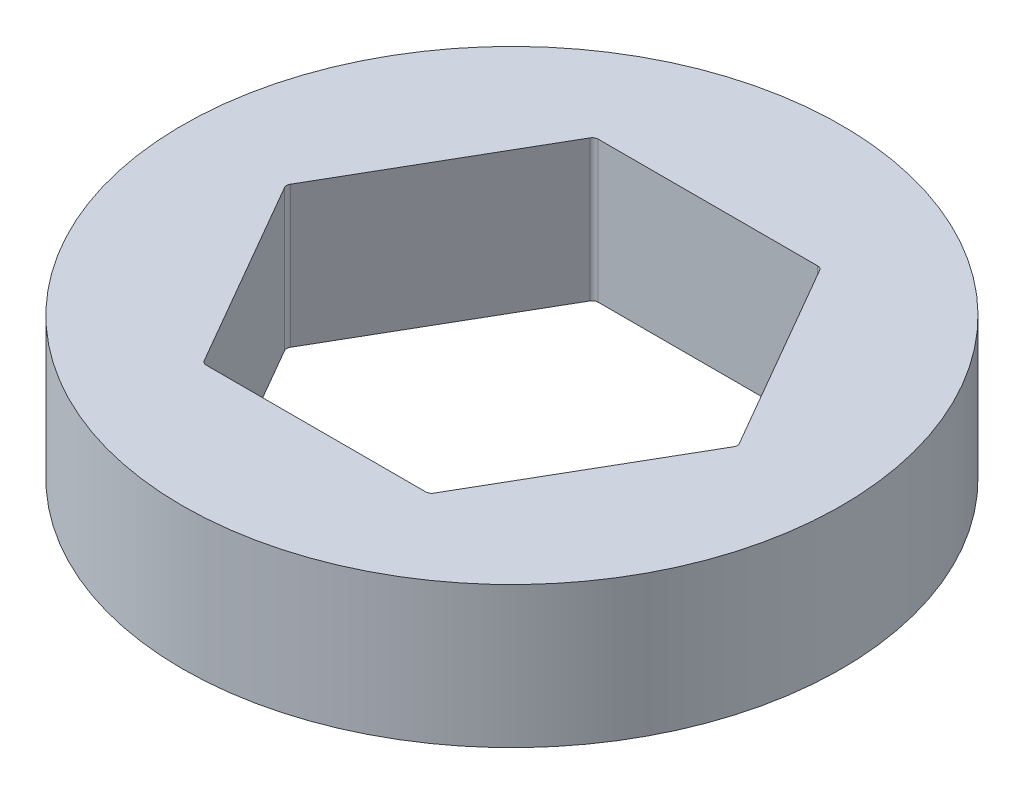
ISO-10303-21;
HEADER;
FILE_DESCRIPTION(('STEP AP214'),'2;1');
FILE_NAME('part.step','',(''),(''),'','','');
FILE_SCHEMA(('AUTOMOTIVE_DESIGN { 1 0 10303 214 1 1 1 1 }'));
ENDSEC;
DATA;
#1=APPLICATION_CONTEXT('core data for automotive mechanical design processes');
#2=APPLICATION_PROTOCOL_DEFINITION('international standard','automotive_design',2000,#1);
#3=PRODUCT_CONTEXT('',#1,'mechanical');
#4=PRODUCT('Part','Part','',(#3));
#5=PRODUCT_RELATED_PRODUCT_CATEGORY('part','',(#4));
#6=PRODUCT_DEFINITION_FORMATION('','',#4);
#7=PRODUCT_DEFINITION_CONTEXT('part definition',#1,'design');
#8=PRODUCT_DEFINITION('design','',#6,#7);
#9=PRODUCT_DEFINITION_SHAPE('','',#8);
#10=(LENGTH_UNIT() NAMED_UNIT(*) SI_UNIT(.MILLI.,.METRE.));
#11=(NAMED_UNIT(*) PLANE_ANGLE_UNIT() SI_UNIT($,.RADIAN.));
#12=(NAMED_UNIT(*) SI_UNIT($,.STERADIAN.) SOLID_ANGLE_UNIT());
#13=UNCERTAINTY_MEASURE_WITH_UNIT(LENGTH_MEASURE(1.E-05),#10,'distance_accuracy_value','');
#14=(GEOMETRIC_REPRESENTATION_CONTEXT(3) GLOBAL_UNCERTAINTY_ASSIGNED_CONTEXT((#13)) GLOBAL_UNIT_ASSIGNED_CONTEXT((#10,
#11,#12)) REPRESENTATION_CONTEXT('',''));
#15=CARTESIAN_POINT('',(0.,0.,0.));
#16=DIRECTION('',(0.,0.,1.));
#17=DIRECTION('',(1.,0.,0.));
#18=AXIS2_PLACEMENT_3D('',#15,#16,#17);
#19=CARTESIAN_POINT('',(0.,4.7625,0.));
#20=DIRECTION('',(0.,1.,0.));
#21=DIRECTION('',(0.,0.,1.));
#22=AXIS2_PLACEMENT_3D('',#19,#20,#21);
#23=PLANE('',#22);
#24=CARTESIAN_POINT('',(0.,4.7625,0.));
#25=DIRECTION('',(0.,1.,0.));
#26=DIRECTION('',(0.,0.,1.));
#27=AXIS2_PLACEMENT_3D('',#24,#25,#26);
#28=CIRCLE('',#27,11.1125);
#29=CARTESIAN_POINT('',(0.,4.7625,11.1125));
#30=VERTEX_POINT('',#29);
#31=EDGE_CURVE('E147',#30,#30,#28,.T.);
#32=ORIENTED_EDGE('',*,*,#31,.T.);
#33=EDGE_LOOP('',(#32));
#34=FACE_BOUND('',#33,.T.);
#35=DIRECTION('',(-0.5,0.,-0.866025403784438));
#36=VECTOR('',#35,1.);
#37=CARTESIAN_POINT('',(7.62564235545658,4.7625,0.));
#38=LINE('',#37,#36);
#39=CARTESIAN_POINT('',(7.56790732853761,4.7625,-0.100000000000002));
#40=VERTEX_POINT('',#39);
#41=CARTESIAN_POINT('',(3.87055620464725,4.7625,-6.504));
#42=VERTEX_POINT('',#41);
#43=EDGE_CURVE('E248',#40,#42,#38,.T.);
#44=ORIENTED_EDGE('',*,*,#43,.F.);
#45=CARTESIAN_POINT('',(7.39470224778073,4.7625,0.));
#46=DIRECTION('',(0.,1.,0.));
#47=DIRECTION('',(0.,0.,1.));
#48=AXIS2_PLACEMENT_3D('',#45,#46,#47);
#49=CIRCLE('',#48,0.2);
#50=CARTESIAN_POINT('',(7.56790732853762,4.7625,0.0999999999999968));
#51=VERTEX_POINT('',#50);
#52=EDGE_CURVE('E50',#40,#51,#49,.F.);
#53=ORIENTED_EDGE('',*,*,#52,.T.);
#54=DIRECTION('',(0.5,0.,-0.866025403784439));
#55=VECTOR('',#54,1.);
#56=CARTESIAN_POINT('',(3.81282117772829,4.7625,6.604));
#57=LINE('',#56,#55);
#58=CARTESIAN_POINT('',(3.87055620464725,4.7625,6.50400000000001));
#59=VERTEX_POINT('',#58);
#60=EDGE_CURVE('E206',#59,#51,#57,.T.);
#61=ORIENTED_EDGE('',*,*,#60,.F.);
#62=CARTESIAN_POINT('',(3.69735112389036,4.7625,6.40400000000001));
#63=DIRECTION('',(0.,1.,0.));
#64=DIRECTION('',(0.,0.,1.));
#65=AXIS2_PLACEMENT_3D('',#62,#63,#64);
#66=CIRCLE('',#65,0.2);
#67=CARTESIAN_POINT('',(3.69735112389036,4.7625,6.604));
#68=VERTEX_POINT('',#67);
#69=EDGE_CURVE('E135',#59,#68,#66,.F.);
#70=ORIENTED_EDGE('',*,*,#69,.T.);
#71=DIRECTION('',(1.,0.,0.));
#72=VECTOR('',#71,1.);
#73=CARTESIAN_POINT('',(-3.81282117772829,4.7625,6.604));
#74=LINE('',#73,#72);
#75=CARTESIAN_POINT('',(-3.69735112389036,4.7625,6.604));
#76=VERTEX_POINT('',#75);
#77=EDGE_CURVE('E213',#76,#68,#74,.T.);
#78=ORIENTED_EDGE('',*,*,#77,.F.);
#79=CARTESIAN_POINT('',(-3.69735112389036,4.7625,6.40400000000001));
#80=DIRECTION('',(0.,1.,0.));
#81=DIRECTION('',(0.,0.,1.));
#82=AXIS2_PLACEMENT_3D('',#79,#80,#81);
#83=CIRCLE('',#82,0.2);
#84=CARTESIAN_POINT('',(-3.87055620464725,4.7625,6.50400000000001));
#85=VERTEX_POINT('',#84);
#86=EDGE_CURVE('E11',#76,#85,#83,.F.);
#87=ORIENTED_EDGE('',*,*,#86,.T.);
#88=DIRECTION('',(0.5,0.,0.866025403784439));
#89=VECTOR('',#88,1.);
#90=CARTESIAN_POINT('',(-7.62564235545658,4.7625,0.));
#91=LINE('',#90,#89);
#92=CARTESIAN_POINT('',(-7.56790732853762,4.7625,0.1));
#93=VERTEX_POINT('',#92);
#94=EDGE_CURVE('E211',#93,#85,#91,.T.);
#95=ORIENTED_EDGE('',*,*,#94,.F.);
#96=CARTESIAN_POINT('',(-7.39470224778073,4.7625,0.));
#97=DIRECTION('',(0.,1.,0.));
#98=DIRECTION('',(0.,0.,1.));
#99=AXIS2_PLACEMENT_3D('',#96,#97,#98);
#100=CIRCLE('',#99,0.2);
#101=CARTESIAN_POINT('',(-7.56790732853762,4.7625,-0.0999999999999994));
#102=VERTEX_POINT('',#101);
#103=EDGE_CURVE('E188',#93,#102,#100,.F.);
#104=ORIENTED_EDGE('',*,*,#103,.T.);
#105=DIRECTION('',(-0.5,0.,0.866025403784439));
#106=VECTOR('',#105,1.);
#107=CARTESIAN_POINT('',(-3.81282117772829,4.7625,-6.604));
#108=LINE('',#107,#106);
#109=CARTESIAN_POINT('',(-3.87055620464725,4.7625,-6.504));
#110=VERTEX_POINT('',#109);
#111=EDGE_CURVE('E217',#110,#102,#108,.T.);
#112=ORIENTED_EDGE('',*,*,#111,.F.);
#113=CARTESIAN_POINT('',(-3.69735112389037,4.7625,-6.404));
#114=DIRECTION('',(0.,1.,0.));
#115=DIRECTION('',(0.,0.,1.));
#116=AXIS2_PLACEMENT_3D('',#113,#114,#115);
#117=CIRCLE('',#116,0.2);
#118=CARTESIAN_POINT('',(-3.69735112389037,4.7625,-6.604));
#119=VERTEX_POINT('',#118);
#120=EDGE_CURVE('E184',#110,#119,#117,.F.);
#121=ORIENTED_EDGE('',*,*,#120,.T.);
#122=DIRECTION('',(-1.,0.,0.));
#123=VECTOR('',#122,1.);
#124=CARTESIAN_POINT('',(3.81282117772829,4.7625,-6.604));
#125=LINE('',#124,#123);
#126=CARTESIAN_POINT('',(3.69735112389036,4.7625,-6.604));
#127=VERTEX_POINT('',#126);
#128=EDGE_CURVE('E221',#127,#119,#125,.T.);
#129=ORIENTED_EDGE('',*,*,#128,.F.);
#130=CARTESIAN_POINT('',(3.69735112389036,4.7625,-6.404));
#131=DIRECTION('',(0.,1.,0.));
#132=DIRECTION('',(0.,0.,1.));
#133=AXIS2_PLACEMENT_3D('',#130,#131,#132);
#134=CIRCLE('',#133,0.2);
#135=EDGE_CURVE('E180',#127,#42,#134,.F.);
#136=ORIENTED_EDGE('',*,*,#135,.T.);
#137=EDGE_LOOP('',(#44,#53,#61,#70,#78,#87,#95,#104,#112,#121,#129,#136));
#138=FACE_BOUND('',#137,.T.);
#139=ADVANCED_FACE('F35',(#34,#138),#23,.T.);
#140=CARTESIAN_POINT('',(0.,0.,0.));
#141=DIRECTION('',(0.,1.,0.));
#142=DIRECTION('',(0.,0.,1.));
#143=AXIS2_PLACEMENT_3D('',#140,#141,#142);
#144=PLANE('',#143);
#145=CARTESIAN_POINT('',(0.,0.,0.));
#146=DIRECTION('',(0.,1.,0.));
#147=DIRECTION('',(0.,0.,1.));
#148=AXIS2_PLACEMENT_3D('',#145,#146,#147);
#149=CIRCLE('',#148,11.1125);
#150=CARTESIAN_POINT('',(0.,0.,11.1125));
#151=VERTEX_POINT('',#150);
#152=EDGE_CURVE('E152',#151,#151,#149,.T.);
#153=ORIENTED_EDGE('',*,*,#152,.F.);
#154=EDGE_LOOP('',(#153));
#155=FACE_BOUND('',#154,.T.);
#156=DIRECTION('',(1.,0.,0.));
#157=VECTOR('',#156,1.);
#158=CARTESIAN_POINT('',(-3.81282117772829,0.,6.604));
#159=LINE('',#158,#157);
#160=CARTESIAN_POINT('',(-3.69735112389036,0.,6.604));
#161=VERTEX_POINT('',#160);
#162=CARTESIAN_POINT('',(3.69735112389036,0.,6.604));
#163=VERTEX_POINT('',#162);
#164=EDGE_CURVE('E195',#161,#163,#159,.T.);
#165=ORIENTED_EDGE('',*,*,#164,.T.);
#166=CARTESIAN_POINT('',(3.69735112389036,0.,6.40400000000001));
#167=DIRECTION('',(0.,1.,0.));
#168=DIRECTION('',(0.,0.,1.));
#169=AXIS2_PLACEMENT_3D('',#166,#167,#168);
#170=CIRCLE('',#169,0.2);
#171=CARTESIAN_POINT('',(3.87055620464725,0.,6.50400000000001));
#172=VERTEX_POINT('',#171);
#173=EDGE_CURVE('E190',#163,#172,#170,.T.);
#174=ORIENTED_EDGE('',*,*,#173,.T.);
#175=DIRECTION('',(0.5,0.,-0.866025403784439));
#176=VECTOR('',#175,1.);
#177=CARTESIAN_POINT('',(3.81282117772829,0.,6.604));
#178=LINE('',#177,#176);
#179=CARTESIAN_POINT('',(7.56790732853762,0.,0.0999999999999968));
#180=VERTEX_POINT('',#179);
#181=EDGE_CURVE('E130',#172,#180,#178,.T.);
#182=ORIENTED_EDGE('',*,*,#181,.T.);
#183=CARTESIAN_POINT('',(7.39470224778073,0.,0.));
#184=DIRECTION('',(0.,1.,0.));
#185=DIRECTION('',(0.,0.,1.));
#186=AXIS2_PLACEMENT_3D('',#183,#184,#185);
#187=CIRCLE('',#186,0.2);
#188=CARTESIAN_POINT('',(7.56790732853761,0.,-0.100000000000002));
#189=VERTEX_POINT('',#188);
#190=EDGE_CURVE('E125',#180,#189,#187,.T.);
#191=ORIENTED_EDGE('',*,*,#190,.T.);
#192=DIRECTION('',(-0.5,0.,-0.866025403784438));
#193=VECTOR('',#192,1.);
#194=CARTESIAN_POINT('',(7.62564235545658,0.,0.));
#195=LINE('',#194,#193);
#196=CARTESIAN_POINT('',(3.87055620464725,0.,-6.504));
#197=VERTEX_POINT('',#196);
#198=EDGE_CURVE('E129',#189,#197,#195,.T.);
#199=ORIENTED_EDGE('',*,*,#198,.T.);
#200=CARTESIAN_POINT('',(3.69735112389036,0.,-6.404));
#201=DIRECTION('',(0.,1.,0.));
#202=DIRECTION('',(0.,0.,1.));
#203=AXIS2_PLACEMENT_3D('',#200,#201,#202);
#204=CIRCLE('',#203,0.2);
#205=CARTESIAN_POINT('',(3.69735112389036,0.,-6.604));
#206=VERTEX_POINT('',#205);
#207=EDGE_CURVE('E178',#197,#206,#204,.T.);
#208=ORIENTED_EDGE('',*,*,#207,.T.);
#209=DIRECTION('',(-1.,0.,0.));
#210=VECTOR('',#209,1.);
#211=CARTESIAN_POINT('',(3.81282117772829,0.,-6.604));
#212=LINE('',#211,#210);
#213=CARTESIAN_POINT('',(-3.69735112389037,0.,-6.604));
#214=VERTEX_POINT('',#213);
#215=EDGE_CURVE('E144',#206,#214,#212,.T.);
#216=ORIENTED_EDGE('',*,*,#215,.T.);
#217=CARTESIAN_POINT('',(-3.69735112389037,0.,-6.404));
#218=DIRECTION('',(0.,1.,0.));
#219=DIRECTION('',(0.,0.,1.));
#220=AXIS2_PLACEMENT_3D('',#217,#218,#219);
#221=CIRCLE('',#220,0.2);
#222=CARTESIAN_POINT('',(-3.87055620464725,0.,-6.504));
#223=VERTEX_POINT('',#222);
#224=EDGE_CURVE('E182',#214,#223,#221,.T.);
#225=ORIENTED_EDGE('',*,*,#224,.T.);
#226=DIRECTION('',(-0.5,0.,0.866025403784439));
#227=VECTOR('',#226,1.);
#228=CARTESIAN_POINT('',(-3.81282117772829,0.,-6.604));
#229=LINE('',#228,#227);
#230=CARTESIAN_POINT('',(-7.56790732853762,0.,-0.0999999999999994));
#231=VERTEX_POINT('',#230);
#232=EDGE_CURVE('E228',#223,#231,#229,.T.);
#233=ORIENTED_EDGE('',*,*,#232,.T.);
#234=CARTESIAN_POINT('',(-7.39470224778073,0.,0.));
#235=DIRECTION('',(0.,1.,0.));
#236=DIRECTION('',(0.,0.,1.));
#237=AXIS2_PLACEMENT_3D('',#234,#235,#236);
#238=CIRCLE('',#237,0.2);
#239=CARTESIAN_POINT('',(-7.56790732853762,0.,0.1));
#240=VERTEX_POINT('',#239);
#241=EDGE_CURVE('E186',#231,#240,#238,.T.);
#242=ORIENTED_EDGE('',*,*,#241,.T.);
#243=DIRECTION('',(0.5,0.,0.866025403784439));
#244=VECTOR('',#243,1.);
#245=CARTESIAN_POINT('',(-7.62564235545658,0.,0.));
#246=LINE('',#245,#244);
#247=CARTESIAN_POINT('',(-3.87055620464725,0.,6.50400000000001));
#248=VERTEX_POINT('',#247);
#249=EDGE_CURVE('E197',#240,#248,#246,.T.);
#250=ORIENTED_EDGE('',*,*,#249,.T.);
#251=CARTESIAN_POINT('',(-3.69735112389036,0.,6.40400000000001));
#252=DIRECTION('',(0.,1.,0.));
#253=DIRECTION('',(0.,0.,1.));
#254=AXIS2_PLACEMENT_3D('',#251,#252,#253);
#255=CIRCLE('',#254,0.2);
#256=EDGE_CURVE('E43',#248,#161,#255,.T.);
#257=ORIENTED_EDGE('',*,*,#256,.T.);
#258=EDGE_LOOP('',(#165,#174,#182,#191,#199,#208,#216,#225,#233,#242,#250,#257));
#259=FACE_BOUND('',#258,.T.);
#260=ADVANCED_FACE('F128',(#155,#259),#144,.F.);
#261=CARTESIAN_POINT('',(0.,4.7625,0.));
#262=DIRECTION('',(0.,-1.,0.));
#263=DIRECTION('',(0.,0.,-1.));
#264=AXIS2_PLACEMENT_3D('',#261,#262,#263);
#265=CYLINDRICAL_SURFACE('',#264,11.1125);
#266=ORIENTED_EDGE('',*,*,#31,.F.);
#267=EDGE_LOOP('',(#266));
#268=FACE_BOUND('',#267,.T.);
#269=ORIENTED_EDGE('',*,*,#152,.T.);
#270=EDGE_LOOP('',(#269));
#271=FACE_BOUND('',#270,.T.);
#272=ADVANCED_FACE('F270',(#268,#271),#265,.T.);
#273=CARTESIAN_POINT('',(3.81282117772829,4.7625,6.604));
#274=DIRECTION('',(-0.866025403784439,0.,-0.5));
#275=DIRECTION('',(-0.5,0.,0.866025403784439));
#276=AXIS2_PLACEMENT_3D('',#273,#274,#275);
#277=PLANE('',#276);
#278=ORIENTED_EDGE('',*,*,#181,.F.);
#279=DIRECTION('',(0.,-1.,0.));
#280=VECTOR('',#279,1.);
#281=CARTESIAN_POINT('',(3.87055620464725,4.7625,6.50400000000001));
#282=LINE('',#281,#280);
#283=EDGE_CURVE('E57',#172,#59,#282,.F.);
#284=ORIENTED_EDGE('',*,*,#283,.T.);
#285=ORIENTED_EDGE('',*,*,#60,.T.);
#286=DIRECTION('',(0.,-1.,0.));
#287=VECTOR('',#286,1.);
#288=CARTESIAN_POINT('',(7.56790732853762,0.,0.0999999999999974));
#289=LINE('',#288,#287);
#290=EDGE_CURVE('E175',#51,#180,#289,.T.);
#291=ORIENTED_EDGE('',*,*,#290,.T.);
#292=EDGE_LOOP('',(#278,#284,#285,#291));
#293=FACE_BOUND('',#292,.T.);
#294=ADVANCED_FACE('F251',(#293),#277,.T.);
#295=CARTESIAN_POINT('',(7.62564235545658,4.7625,0.));
#296=DIRECTION('',(-0.866025403784439,0.,0.5));
#297=DIRECTION('',(0.5,0.,0.866025403784438));
#298=AXIS2_PLACEMENT_3D('',#295,#296,#297);
#299=PLANE('',#298);
#300=ORIENTED_EDGE('',*,*,#43,.T.);
#301=DIRECTION('',(0.,-1.,0.));
#302=VECTOR('',#301,1.);
#303=CARTESIAN_POINT('',(3.87055620464725,0.,-6.504));
#304=LINE('',#303,#302);
#305=EDGE_CURVE('E143',#42,#197,#304,.T.);
#306=ORIENTED_EDGE('',*,*,#305,.T.);
#307=ORIENTED_EDGE('',*,*,#198,.F.);
#308=DIRECTION('',(0.,-1.,0.));
#309=VECTOR('',#308,1.);
#310=CARTESIAN_POINT('',(7.56790732853761,4.7625,-0.100000000000002));
#311=LINE('',#310,#309);
#312=EDGE_CURVE('E141',#189,#40,#311,.F.);
#313=ORIENTED_EDGE('',*,*,#312,.T.);
#314=EDGE_LOOP('',(#300,#306,#307,#313));
#315=FACE_BOUND('',#314,.T.);
#316=ADVANCED_FACE('F140',(#315),#299,.T.);
#317=CARTESIAN_POINT('',(3.81282117772829,4.7625,-6.604));
#318=DIRECTION('',(0.,0.,1.));
#319=DIRECTION('',(1.,0.,0.));
#320=AXIS2_PLACEMENT_3D('',#317,#318,#319);
#321=PLANE('',#320);
#322=ORIENTED_EDGE('',*,*,#215,.F.);
#323=DIRECTION('',(0.,-1.,0.));
#324=VECTOR('',#323,1.);
#325=CARTESIAN_POINT('',(3.69735112389036,4.7625,-6.604));
#326=LINE('',#325,#324);
#327=EDGE_CURVE('E158',#206,#127,#326,.F.);
#328=ORIENTED_EDGE('',*,*,#327,.T.);
#329=ORIENTED_EDGE('',*,*,#128,.T.);
#330=DIRECTION('',(0.,-1.,0.));
#331=VECTOR('',#330,1.);
#332=CARTESIAN_POINT('',(-3.69735112389037,0.,-6.604));
#333=LINE('',#332,#331);
#334=EDGE_CURVE('E149',#119,#214,#333,.T.);
#335=ORIENTED_EDGE('',*,*,#334,.T.);
#336=EDGE_LOOP('',(#322,#328,#329,#335));
#337=FACE_BOUND('',#336,.T.);
#338=ADVANCED_FACE('F246',(#337),#321,.T.);
#339=CARTESIAN_POINT('',(-3.81282117772829,4.7625,-6.604));
#340=DIRECTION('',(0.866025403784439,0.,0.5));
#341=DIRECTION('',(0.5,0.,-0.866025403784439));
#342=AXIS2_PLACEMENT_3D('',#339,#340,#341);
#343=PLANE('',#342);
#344=ORIENTED_EDGE('',*,*,#232,.F.);
#345=DIRECTION('',(0.,-1.,0.));
#346=VECTOR('',#345,1.);
#347=CARTESIAN_POINT('',(-3.87055620464725,4.7625,-6.504));
#348=LINE('',#347,#346);
#349=EDGE_CURVE('E163',#223,#110,#348,.F.);
#350=ORIENTED_EDGE('',*,*,#349,.T.);
#351=ORIENTED_EDGE('',*,*,#111,.T.);
#352=DIRECTION('',(0.,-1.,0.));
#353=VECTOR('',#352,1.);
#354=CARTESIAN_POINT('',(-7.56790732853762,0.,-0.0999999999999992));
#355=LINE('',#354,#353);
#356=EDGE_CURVE('E160',#102,#231,#355,.T.);
#357=ORIENTED_EDGE('',*,*,#356,.T.);
#358=EDGE_LOOP('',(#344,#350,#351,#357));
#359=FACE_BOUND('',#358,.T.);
#360=ADVANCED_FACE('F234',(#359),#343,.T.);
#361=CARTESIAN_POINT('',(-7.62564235545658,4.7625,0.));
#362=DIRECTION('',(0.866025403784439,0.,-0.5));
#363=DIRECTION('',(-0.5,0.,-0.866025403784439));
#364=AXIS2_PLACEMENT_3D('',#361,#362,#363);
#365=PLANE('',#364);
#366=ORIENTED_EDGE('',*,*,#249,.F.);
#367=DIRECTION('',(0.,-1.,0.));
#368=VECTOR('',#367,1.);
#369=CARTESIAN_POINT('',(-7.56790732853762,4.7625,0.1));
#370=LINE('',#369,#368);
#371=EDGE_CURVE('E168',#240,#93,#370,.F.);
#372=ORIENTED_EDGE('',*,*,#371,.T.);
#373=ORIENTED_EDGE('',*,*,#94,.T.);
#374=DIRECTION('',(0.,-1.,0.));
#375=VECTOR('',#374,1.);
#376=CARTESIAN_POINT('',(-3.87055620464725,0.,6.504));
#377=LINE('',#376,#375);
#378=EDGE_CURVE('E165',#85,#248,#377,.T.);
#379=ORIENTED_EDGE('',*,*,#378,.T.);
#380=EDGE_LOOP('',(#366,#372,#373,#379));
#381=FACE_BOUND('',#380,.T.);
#382=ADVANCED_FACE('F215',(#381),#365,.T.);
#383=CARTESIAN_POINT('',(-3.81282117772829,4.7625,6.604));
#384=DIRECTION('',(0.,0.,-1.));
#385=DIRECTION('',(-1.,0.,0.));
#386=AXIS2_PLACEMENT_3D('',#383,#384,#385);
#387=PLANE('',#386);
#388=ORIENTED_EDGE('',*,*,#77,.T.);
#389=DIRECTION('',(0.,-1.,0.));
#390=VECTOR('',#389,1.);
#391=CARTESIAN_POINT('',(3.69735112389036,0.,6.604));
#392=LINE('',#391,#390);
#393=EDGE_CURVE('E172',#68,#163,#392,.T.);
#394=ORIENTED_EDGE('',*,*,#393,.T.);
#395=ORIENTED_EDGE('',*,*,#164,.F.);
#396=DIRECTION('',(0.,-1.,0.));
#397=VECTOR('',#396,1.);
#398=CARTESIAN_POINT('',(-3.69735112389036,4.7625,6.604));
#399=LINE('',#398,#397);
#400=EDGE_CURVE('E170',#161,#76,#399,.F.);
#401=ORIENTED_EDGE('',*,*,#400,.T.);
#402=EDGE_LOOP('',(#388,#394,#395,#401));
#403=FACE_BOUND('',#402,.T.);
#404=ADVANCED_FACE('F203',(#403),#387,.T.);
#405=CARTESIAN_POINT('',(3.69735112389036,4.7625,-6.404));
#406=DIRECTION('',(0.,1.,0.));
#407=DIRECTION('',(0.,0.,1.));
#408=AXIS2_PLACEMENT_3D('',#405,#406,#407);
#409=CYLINDRICAL_SURFACE('',#408,0.2);
#410=ORIENTED_EDGE('',*,*,#135,.F.);
#411=ORIENTED_EDGE('',*,*,#327,.F.);
#412=ORIENTED_EDGE('',*,*,#207,.F.);
#413=ORIENTED_EDGE('',*,*,#305,.F.);
#414=EDGE_LOOP('',(#410,#411,#412,#413));
#415=FACE_BOUND('',#414,.T.);
#416=ADVANCED_FACE('F279',(#415),#409,.F.);
#417=CARTESIAN_POINT('',(-3.69735112389037,4.7625,-6.404));
#418=DIRECTION('',(0.,1.,0.));
#419=DIRECTION('',(0.,0.,1.));
#420=AXIS2_PLACEMENT_3D('',#417,#418,#419);
#421=CYLINDRICAL_SURFACE('',#420,0.2);
#422=ORIENTED_EDGE('',*,*,#120,.F.);
#423=ORIENTED_EDGE('',*,*,#349,.F.);
#424=ORIENTED_EDGE('',*,*,#224,.F.);
#425=ORIENTED_EDGE('',*,*,#334,.F.);
#426=EDGE_LOOP('',(#422,#423,#424,#425));
#427=FACE_BOUND('',#426,.T.);
#428=ADVANCED_FACE('F239',(#427),#421,.F.);
#429=CARTESIAN_POINT('',(-7.39470224778073,4.7625,0.));
#430=DIRECTION('',(0.,1.,0.));
#431=DIRECTION('',(0.,0.,1.));
#432=AXIS2_PLACEMENT_3D('',#429,#430,#431);
#433=CYLINDRICAL_SURFACE('',#432,0.2);
#434=ORIENTED_EDGE('',*,*,#103,.F.);
#435=ORIENTED_EDGE('',*,*,#371,.F.);
#436=ORIENTED_EDGE('',*,*,#241,.F.);
#437=ORIENTED_EDGE('',*,*,#356,.F.);
#438=EDGE_LOOP('',(#434,#435,#436,#437));
#439=FACE_BOUND('',#438,.T.);
#440=ADVANCED_FACE('F256',(#439),#433,.F.);
#441=CARTESIAN_POINT('',(3.69735112389036,4.7625,6.40400000000001));
#442=DIRECTION('',(0.,1.,0.));
#443=DIRECTION('',(0.,0.,1.));
#444=AXIS2_PLACEMENT_3D('',#441,#442,#443);
#445=CYLINDRICAL_SURFACE('',#444,0.2);
#446=ORIENTED_EDGE('',*,*,#69,.F.);
#447=ORIENTED_EDGE('',*,*,#283,.F.);
#448=ORIENTED_EDGE('',*,*,#173,.F.);
#449=ORIENTED_EDGE('',*,*,#393,.F.);
#450=EDGE_LOOP('',(#446,#447,#448,#449));
#451=FACE_BOUND('',#450,.T.);
#452=ADVANCED_FACE('F254',(#451),#445,.F.);
#453=CARTESIAN_POINT('',(7.39470224778073,4.7625,0.));
#454=DIRECTION('',(0.,1.,0.));
#455=DIRECTION('',(0.,0.,1.));
#456=AXIS2_PLACEMENT_3D('',#453,#454,#455);
#457=CYLINDRICAL_SURFACE('',#456,0.2);
#458=ORIENTED_EDGE('',*,*,#52,.F.);
#459=ORIENTED_EDGE('',*,*,#312,.F.);
#460=ORIENTED_EDGE('',*,*,#190,.F.);
#461=ORIENTED_EDGE('',*,*,#290,.F.);
#462=EDGE_LOOP('',(#458,#459,#460,#461));
#463=FACE_BOUND('',#462,.T.);
#464=ADVANCED_FACE('F146',(#463),#457,.F.);
#465=CARTESIAN_POINT('',(-3.69735112389036,4.7625,6.40400000000001));
#466=DIRECTION('',(0.,1.,0.));
#467=DIRECTION('',(0.,0.,1.));
#468=AXIS2_PLACEMENT_3D('',#465,#466,#467);
#469=CYLINDRICAL_SURFACE('',#468,0.2);
#470=ORIENTED_EDGE('',*,*,#86,.F.);
#471=ORIENTED_EDGE('',*,*,#400,.F.);
#472=ORIENTED_EDGE('',*,*,#256,.F.);
#473=ORIENTED_EDGE('',*,*,#378,.F.);
#474=EDGE_LOOP('',(#470,#471,#472,#473));
#475=FACE_BOUND('',#474,.T.);
#476=ADVANCED_FACE('F37',(#475),#469,.F.);
#477=CLOSED_SHELL('',(#139,#260,#272,#294,#316,#338,#360,#382,#404,#416,#428,#440,#452,#464,#476));
#478=MANIFOLD_SOLID_BREP('B2',#477);
#479=ADVANCED_BREP_SHAPE_REPRESENTATION('',(#18,#478),#14);
#480=SHAPE_DEFINITION_REPRESENTATION(#9,#479);
ENDSEC;
END-ISO-10303-21;
